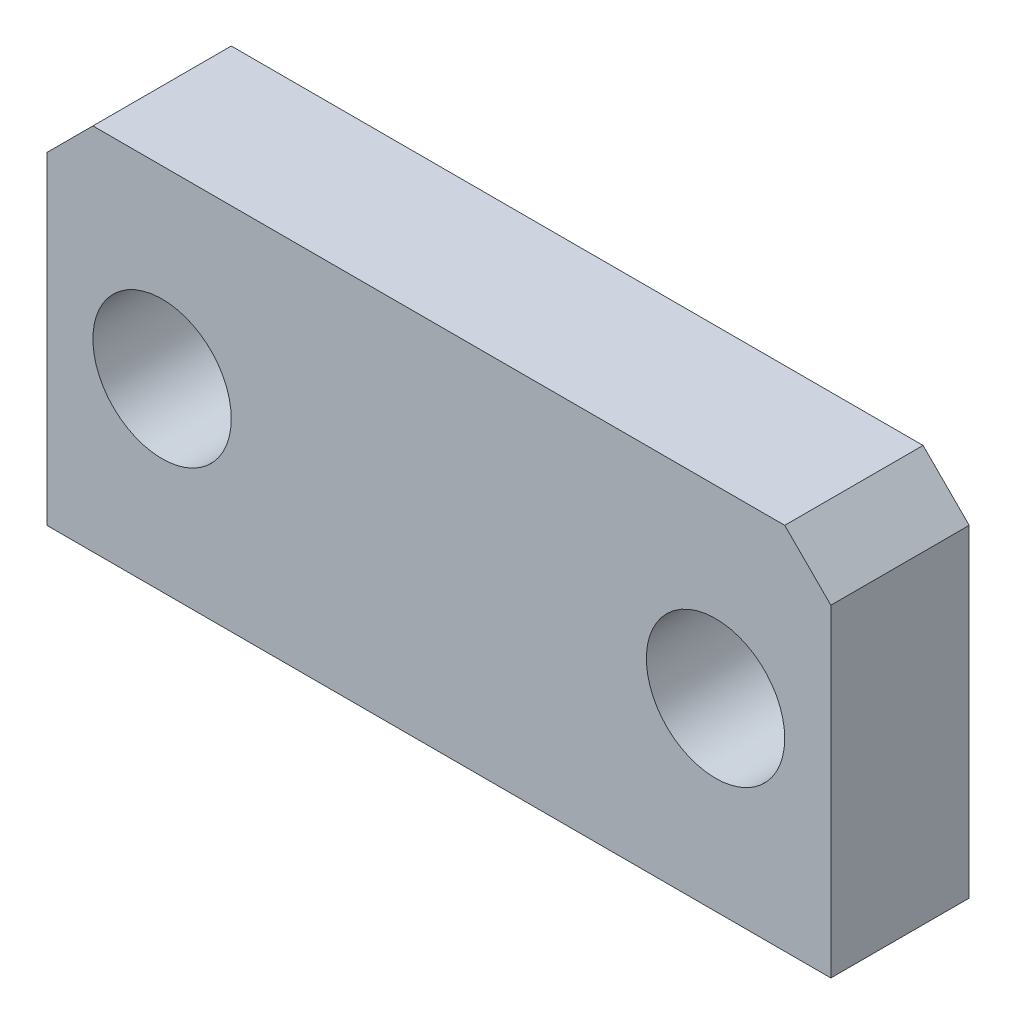
ISO-10303-21;
HEADER;
FILE_DESCRIPTION(('STEP AP214'),'2;1');
FILE_NAME('part.step','',(''),(''),'','','');
FILE_SCHEMA(('AUTOMOTIVE_DESIGN { 1 0 10303 214 1 1 1 1 }'));
ENDSEC;
DATA;
#1=APPLICATION_CONTEXT('core data for automotive mechanical design processes');
#2=APPLICATION_PROTOCOL_DEFINITION('international standard','automotive_design',2000,#1);
#3=PRODUCT_CONTEXT('',#1,'mechanical');
#4=PRODUCT('Part','Part','',(#3));
#5=PRODUCT_RELATED_PRODUCT_CATEGORY('part','',(#4));
#6=PRODUCT_DEFINITION_FORMATION('','',#4);
#7=PRODUCT_DEFINITION_CONTEXT('part definition',#1,'design');
#8=PRODUCT_DEFINITION('design','',#6,#7);
#9=PRODUCT_DEFINITION_SHAPE('','',#8);
#10=(LENGTH_UNIT() NAMED_UNIT(*) SI_UNIT(.MILLI.,.METRE.));
#11=(NAMED_UNIT(*) PLANE_ANGLE_UNIT() SI_UNIT($,.RADIAN.));
#12=(NAMED_UNIT(*) SI_UNIT($,.STERADIAN.) SOLID_ANGLE_UNIT());
#13=UNCERTAINTY_MEASURE_WITH_UNIT(LENGTH_MEASURE(1.E-05),#10,'distance_accuracy_value','');
#14=(GEOMETRIC_REPRESENTATION_CONTEXT(3) GLOBAL_UNCERTAINTY_ASSIGNED_CONTEXT((#13)) GLOBAL_UNIT_ASSIGNED_CONTEXT((#10,
#11,#12)) REPRESENTATION_CONTEXT('',''));
#15=CARTESIAN_POINT('',(0.,0.,0.));
#16=DIRECTION('',(0.,0.,1.));
#17=DIRECTION('',(1.,0.,0.));
#18=AXIS2_PLACEMENT_3D('',#15,#16,#17);
#19=CARTESIAN_POINT('',(0.,0.,3.));
#20=DIRECTION('',(0.,0.,-1.));
#21=DIRECTION('',(-1.,0.,0.));
#22=AXIS2_PLACEMENT_3D('',#19,#20,#21);
#23=PLANE('',#22);
#24=DIRECTION('',(0.,1.,0.));
#25=VECTOR('',#24,1.);
#26=CARTESIAN_POINT('',(8.5,-4.,3.));
#27=LINE('',#26,#25);
#28=CARTESIAN_POINT('',(8.5,-4.,3.));
#29=VERTEX_POINT('',#28);
#30=CARTESIAN_POINT('',(8.5,3.,3.));
#31=VERTEX_POINT('',#30);
#32=EDGE_CURVE('E120',#29,#31,#27,.T.);
#33=ORIENTED_EDGE('',*,*,#32,.T.);
#34=DIRECTION('',(0.707106781186546,-0.707106781186549,0.));
#35=VECTOR('',#34,1.);
#36=CARTESIAN_POINT('',(7.5,4.,3.));
#37=LINE('',#36,#35);
#38=CARTESIAN_POINT('',(7.5,4.,3.));
#39=VERTEX_POINT('',#38);
#40=EDGE_CURVE('E41',#31,#39,#37,.F.);
#41=ORIENTED_EDGE('',*,*,#40,.T.);
#42=DIRECTION('',(-1.,0.,0.));
#43=VECTOR('',#42,1.);
#44=CARTESIAN_POINT('',(-8.5,4.,3.));
#45=LINE('',#44,#43);
#46=CARTESIAN_POINT('',(-7.49999999999999,4.,3.));
#47=VERTEX_POINT('',#46);
#48=EDGE_CURVE('E94',#39,#47,#45,.T.);
#49=ORIENTED_EDGE('',*,*,#48,.T.);
#50=DIRECTION('',(0.70710678118655,0.707106781186545,0.));
#51=VECTOR('',#50,1.);
#52=CARTESIAN_POINT('',(-8.5,3.,3.));
#53=LINE('',#52,#51);
#54=CARTESIAN_POINT('',(-8.5,3.,3.));
#55=VERTEX_POINT('',#54);
#56=EDGE_CURVE('E48',#47,#55,#53,.F.);
#57=ORIENTED_EDGE('',*,*,#56,.T.);
#58=DIRECTION('',(0.,-1.,0.));
#59=VECTOR('',#58,1.);
#60=CARTESIAN_POINT('',(-8.5,-4.,3.));
#61=LINE('',#60,#59);
#62=CARTESIAN_POINT('',(-8.5,-4.,3.));
#63=VERTEX_POINT('',#62);
#64=EDGE_CURVE('E86',#55,#63,#61,.T.);
#65=ORIENTED_EDGE('',*,*,#64,.T.);
#66=DIRECTION('',(1.,0.,0.));
#67=VECTOR('',#66,1.);
#68=CARTESIAN_POINT('',(-8.5,-4.,3.));
#69=LINE('',#68,#67);
#70=EDGE_CURVE('E90',#63,#29,#69,.T.);
#71=ORIENTED_EDGE('',*,*,#70,.T.);
#72=EDGE_LOOP('',(#33,#41,#49,#57,#65,#71));
#73=FACE_BOUND('',#72,.T.);
#74=CARTESIAN_POINT('',(-6.,0.,3.));
#75=DIRECTION('',(0.,0.,1.));
#76=DIRECTION('',(1.,0.,0.));
#77=AXIS2_PLACEMENT_3D('',#74,#75,#76);
#78=CIRCLE('',#77,1.5);
#79=CARTESIAN_POINT('',(-4.5,0.,3.));
#80=VERTEX_POINT('',#79);
#81=EDGE_CURVE('E115',#80,#80,#78,.T.);
#82=ORIENTED_EDGE('',*,*,#81,.F.);
#83=EDGE_LOOP('',(#82));
#84=FACE_BOUND('',#83,.T.);
#85=CARTESIAN_POINT('',(6.,0.,3.));
#86=DIRECTION('',(0.,0.,1.));
#87=DIRECTION('',(1.,0.,0.));
#88=AXIS2_PLACEMENT_3D('',#85,#86,#87);
#89=CIRCLE('',#88,1.5);
#90=CARTESIAN_POINT('',(7.5,0.,3.));
#91=VERTEX_POINT('',#90);
#92=EDGE_CURVE('E150',#91,#91,#89,.T.);
#93=ORIENTED_EDGE('',*,*,#92,.F.);
#94=EDGE_LOOP('',(#93));
#95=FACE_BOUND('',#94,.T.);
#96=ADVANCED_FACE('F33',(#73,#84,#95),#23,.F.);
#97=CARTESIAN_POINT('',(0.,0.,0.));
#98=DIRECTION('',(0.,0.,-1.));
#99=DIRECTION('',(-1.,0.,0.));
#100=AXIS2_PLACEMENT_3D('',#97,#98,#99);
#101=PLANE('',#100);
#102=CARTESIAN_POINT('',(-6.,0.,0.));
#103=DIRECTION('',(0.,0.,1.));
#104=DIRECTION('',(1.,0.,0.));
#105=AXIS2_PLACEMENT_3D('',#102,#103,#104);
#106=CIRCLE('',#105,1.5);
#107=CARTESIAN_POINT('',(-4.5,0.,0.));
#108=VERTEX_POINT('',#107);
#109=EDGE_CURVE('E147',#108,#108,#106,.T.);
#110=ORIENTED_EDGE('',*,*,#109,.T.);
#111=EDGE_LOOP('',(#110));
#112=FACE_BOUND('',#111,.T.);
#113=DIRECTION('',(-1.,0.,0.));
#114=VECTOR('',#113,1.);
#115=CARTESIAN_POINT('',(-8.5,4.,0.));
#116=LINE('',#115,#114);
#117=CARTESIAN_POINT('',(7.5,4.,0.));
#118=VERTEX_POINT('',#117);
#119=CARTESIAN_POINT('',(-7.49999999999999,4.,0.));
#120=VERTEX_POINT('',#119);
#121=EDGE_CURVE('E114',#118,#120,#116,.T.);
#122=ORIENTED_EDGE('',*,*,#121,.F.);
#123=DIRECTION('',(-0.707106781186546,0.707106781186549,0.));
#124=VECTOR('',#123,1.);
#125=CARTESIAN_POINT('',(5.75000000000002,5.75,0.));
#126=LINE('',#125,#124);
#127=CARTESIAN_POINT('',(8.5,3.,0.));
#128=VERTEX_POINT('',#127);
#129=EDGE_CURVE('E128',#118,#128,#126,.F.);
#130=ORIENTED_EDGE('',*,*,#129,.T.);
#131=DIRECTION('',(0.,1.,0.));
#132=VECTOR('',#131,1.);
#133=CARTESIAN_POINT('',(8.5,-4.,0.));
#134=LINE('',#133,#132);
#135=CARTESIAN_POINT('',(8.5,-4.,0.));
#136=VERTEX_POINT('',#135);
#137=EDGE_CURVE('E112',#136,#128,#134,.T.);
#138=ORIENTED_EDGE('',*,*,#137,.F.);
#139=DIRECTION('',(1.,0.,0.));
#140=VECTOR('',#139,1.);
#141=CARTESIAN_POINT('',(-8.5,-4.,0.));
#142=LINE('',#141,#140);
#143=CARTESIAN_POINT('',(-8.5,-4.,0.));
#144=VERTEX_POINT('',#143);
#145=EDGE_CURVE('E119',#144,#136,#142,.T.);
#146=ORIENTED_EDGE('',*,*,#145,.F.);
#147=DIRECTION('',(0.,-1.,0.));
#148=VECTOR('',#147,1.);
#149=CARTESIAN_POINT('',(-8.5,-4.,0.));
#150=LINE('',#149,#148);
#151=CARTESIAN_POINT('',(-8.5,3.,0.));
#152=VERTEX_POINT('',#151);
#153=EDGE_CURVE('E100',#152,#144,#150,.T.);
#154=ORIENTED_EDGE('',*,*,#153,.F.);
#155=DIRECTION('',(-0.70710678118655,-0.707106781186545,0.));
#156=VECTOR('',#155,1.);
#157=CARTESIAN_POINT('',(-5.74999999999998,5.75000000000001,0.));
#158=LINE('',#157,#156);
#159=EDGE_CURVE('E126',#152,#120,#158,.F.);
#160=ORIENTED_EDGE('',*,*,#159,.T.);
#161=EDGE_LOOP('',(#122,#130,#138,#146,#154,#160));
#162=FACE_BOUND('',#161,.T.);
#163=CARTESIAN_POINT('',(6.,0.,0.));
#164=DIRECTION('',(0.,0.,1.));
#165=DIRECTION('',(1.,0.,0.));
#166=AXIS2_PLACEMENT_3D('',#163,#164,#165);
#167=CIRCLE('',#166,1.5);
#168=CARTESIAN_POINT('',(7.5,0.,0.));
#169=VERTEX_POINT('',#168);
#170=EDGE_CURVE('E153',#169,#169,#167,.T.);
#171=ORIENTED_EDGE('',*,*,#170,.T.);
#172=EDGE_LOOP('',(#171));
#173=FACE_BOUND('',#172,.T.);
#174=ADVANCED_FACE('F142',(#112,#162,#173),#101,.T.);
#175=CARTESIAN_POINT('',(8.5,-4.,3.));
#176=DIRECTION('',(-1.,0.,0.));
#177=DIRECTION('',(0.,0.,1.));
#178=AXIS2_PLACEMENT_3D('',#175,#176,#177);
#179=PLANE('',#178);
#180=ORIENTED_EDGE('',*,*,#137,.T.);
#181=DIRECTION('',(0.,0.,1.));
#182=VECTOR('',#181,1.);
#183=CARTESIAN_POINT('',(8.5,3.,3.));
#184=LINE('',#183,#182);
#185=EDGE_CURVE('E56',#128,#31,#184,.T.);
#186=ORIENTED_EDGE('',*,*,#185,.T.);
#187=ORIENTED_EDGE('',*,*,#32,.F.);
#188=DIRECTION('',(0.,0.,-1.));
#189=VECTOR('',#188,1.);
#190=CARTESIAN_POINT('',(8.5,-4.,3.));
#191=LINE('',#190,#189);
#192=EDGE_CURVE('E104',#29,#136,#191,.T.);
#193=ORIENTED_EDGE('',*,*,#192,.T.);
#194=EDGE_LOOP('',(#180,#186,#187,#193));
#195=FACE_BOUND('',#194,.T.);
#196=ADVANCED_FACE('F144',(#195),#179,.F.);
#197=CARTESIAN_POINT('',(-8.5,4.,3.));
#198=DIRECTION('',(0.,-1.,0.));
#199=DIRECTION('',(0.,0.,-1.));
#200=AXIS2_PLACEMENT_3D('',#197,#198,#199);
#201=PLANE('',#200);
#202=ORIENTED_EDGE('',*,*,#48,.F.);
#203=DIRECTION('',(0.,0.,-1.));
#204=VECTOR('',#203,1.);
#205=CARTESIAN_POINT('',(7.5,4.,3.));
#206=LINE('',#205,#204);
#207=EDGE_CURVE('E123',#39,#118,#206,.T.);
#208=ORIENTED_EDGE('',*,*,#207,.T.);
#209=ORIENTED_EDGE('',*,*,#121,.T.);
#210=DIRECTION('',(0.,0.,1.));
#211=VECTOR('',#210,1.);
#212=CARTESIAN_POINT('',(-7.49999999999999,4.,3.));
#213=LINE('',#212,#211);
#214=EDGE_CURVE('E103',#120,#47,#213,.T.);
#215=ORIENTED_EDGE('',*,*,#214,.T.);
#216=EDGE_LOOP('',(#202,#208,#209,#215));
#217=FACE_BOUND('',#216,.T.);
#218=ADVANCED_FACE('F136',(#217),#201,.F.);
#219=CARTESIAN_POINT('',(-8.5,-4.,3.));
#220=DIRECTION('',(1.,0.,0.));
#221=DIRECTION('',(0.,0.,-1.));
#222=AXIS2_PLACEMENT_3D('',#219,#220,#221);
#223=PLANE('',#222);
#224=ORIENTED_EDGE('',*,*,#64,.F.);
#225=DIRECTION('',(0.,0.,-1.));
#226=VECTOR('',#225,1.);
#227=CARTESIAN_POINT('',(-8.5,3.,3.));
#228=LINE('',#227,#226);
#229=EDGE_CURVE('E11',#55,#152,#228,.T.);
#230=ORIENTED_EDGE('',*,*,#229,.T.);
#231=ORIENTED_EDGE('',*,*,#153,.T.);
#232=DIRECTION('',(0.,0.,-1.));
#233=VECTOR('',#232,1.);
#234=CARTESIAN_POINT('',(-8.5,-4.,3.));
#235=LINE('',#234,#233);
#236=EDGE_CURVE('E97',#63,#144,#235,.T.);
#237=ORIENTED_EDGE('',*,*,#236,.F.);
#238=EDGE_LOOP('',(#224,#230,#231,#237));
#239=FACE_BOUND('',#238,.T.);
#240=ADVANCED_FACE('F98',(#239),#223,.F.);
#241=CARTESIAN_POINT('',(-8.5,-4.,3.));
#242=DIRECTION('',(0.,1.,0.));
#243=DIRECTION('',(0.,0.,1.));
#244=AXIS2_PLACEMENT_3D('',#241,#242,#243);
#245=PLANE('',#244);
#246=ORIENTED_EDGE('',*,*,#145,.T.);
#247=ORIENTED_EDGE('',*,*,#192,.F.);
#248=ORIENTED_EDGE('',*,*,#70,.F.);
#249=ORIENTED_EDGE('',*,*,#236,.T.);
#250=EDGE_LOOP('',(#246,#247,#248,#249));
#251=FACE_BOUND('',#250,.T.);
#252=ADVANCED_FACE('F106',(#251),#245,.F.);
#253=CARTESIAN_POINT('',(-6.,0.,3.));
#254=DIRECTION('',(0.,0.,-1.));
#255=DIRECTION('',(-1.,0.,0.));
#256=AXIS2_PLACEMENT_3D('',#253,#254,#255);
#257=CYLINDRICAL_SURFACE('',#256,1.5);
#258=ORIENTED_EDGE('',*,*,#81,.T.);
#259=EDGE_LOOP('',(#258));
#260=FACE_BOUND('',#259,.T.);
#261=ORIENTED_EDGE('',*,*,#109,.F.);
#262=EDGE_LOOP('',(#261));
#263=FACE_BOUND('',#262,.T.);
#264=ADVANCED_FACE('F170',(#260,#263),#257,.F.);
#265=CARTESIAN_POINT('',(6.,0.,3.));
#266=DIRECTION('',(0.,0.,-1.));
#267=DIRECTION('',(-1.,0.,0.));
#268=AXIS2_PLACEMENT_3D('',#265,#266,#267);
#269=CYLINDRICAL_SURFACE('',#268,1.5);
#270=ORIENTED_EDGE('',*,*,#92,.T.);
#271=EDGE_LOOP('',(#270));
#272=FACE_BOUND('',#271,.T.);
#273=ORIENTED_EDGE('',*,*,#170,.F.);
#274=EDGE_LOOP('',(#273));
#275=FACE_BOUND('',#274,.T.);
#276=ADVANCED_FACE('F159',(#272,#275),#269,.F.);
#277=CARTESIAN_POINT('',(7.5,4.,3.));
#278=DIRECTION('',(-0.707106781186549,-0.707106781186546,0.));
#279=DIRECTION('',(0.,0.,-1.));
#280=AXIS2_PLACEMENT_3D('',#277,#278,#279);
#281=PLANE('',#280);
#282=ORIENTED_EDGE('',*,*,#40,.F.);
#283=ORIENTED_EDGE('',*,*,#185,.F.);
#284=ORIENTED_EDGE('',*,*,#129,.F.);
#285=ORIENTED_EDGE('',*,*,#207,.F.);
#286=EDGE_LOOP('',(#282,#283,#284,#285));
#287=FACE_BOUND('',#286,.T.);
#288=ADVANCED_FACE('F139',(#287),#281,.F.);
#289=CARTESIAN_POINT('',(-8.5,3.,3.));
#290=DIRECTION('',(0.707106781186545,-0.70710678118655,0.));
#291=DIRECTION('',(0.,0.,-1.));
#292=AXIS2_PLACEMENT_3D('',#289,#290,#291);
#293=PLANE('',#292);
#294=ORIENTED_EDGE('',*,*,#56,.F.);
#295=ORIENTED_EDGE('',*,*,#214,.F.);
#296=ORIENTED_EDGE('',*,*,#159,.F.);
#297=ORIENTED_EDGE('',*,*,#229,.F.);
#298=EDGE_LOOP('',(#294,#295,#296,#297));
#299=FACE_BOUND('',#298,.T.);
#300=ADVANCED_FACE('F35',(#299),#293,.F.);
#301=CLOSED_SHELL('',(#96,#174,#196,#218,#240,#252,#264,#276,#288,#300));
#302=MANIFOLD_SOLID_BREP('B2',#301);
#303=ADVANCED_BREP_SHAPE_REPRESENTATION('',(#18,#302),#14);
#304=SHAPE_DEFINITION_REPRESENTATION(#9,#303);
ENDSEC;
END-ISO-10303-21;
